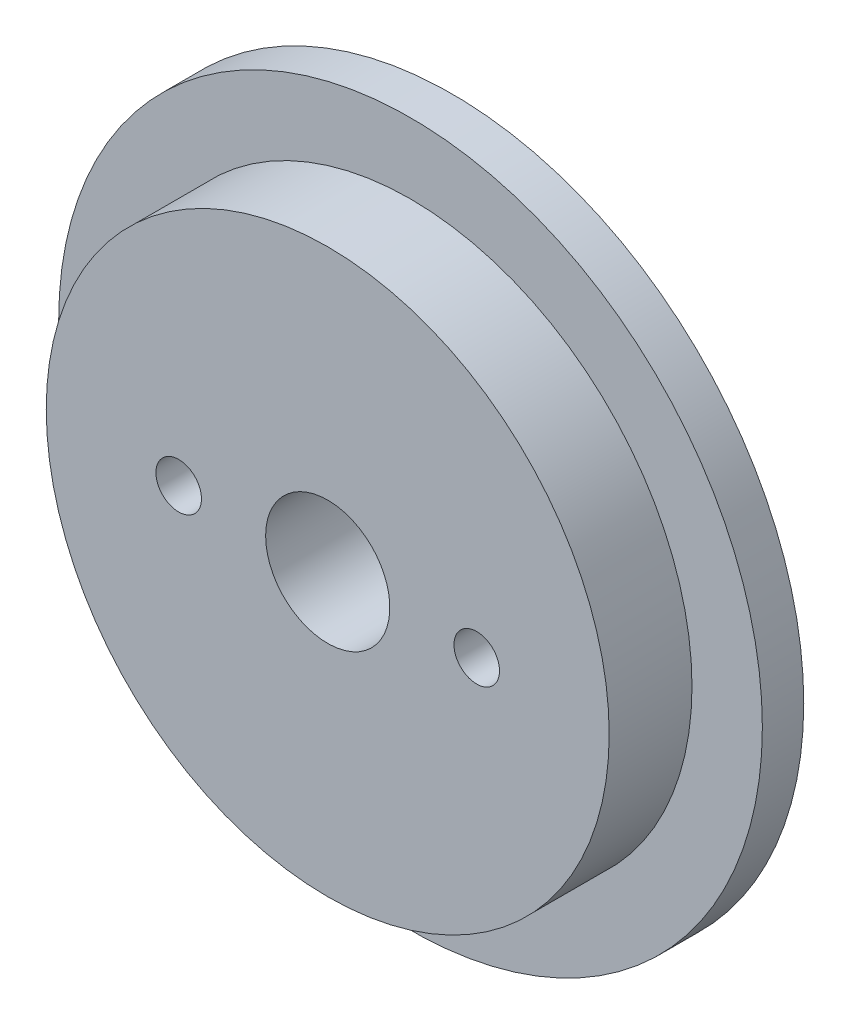
ISO-10303-21;
HEADER;
FILE_DESCRIPTION(('STEP AP214'),'2;1');
FILE_NAME('part.step','',(''),(''),'','','');
FILE_SCHEMA(('AUTOMOTIVE_DESIGN { 1 0 10303 214 1 1 1 1 }'));
ENDSEC;
DATA;
#1=APPLICATION_CONTEXT('core data for automotive mechanical design processes');
#2=APPLICATION_PROTOCOL_DEFINITION('international standard','automotive_design',2000,#1);
#3=PRODUCT_CONTEXT('',#1,'mechanical');
#4=PRODUCT('Part','Part','',(#3));
#5=PRODUCT_RELATED_PRODUCT_CATEGORY('part','',(#4));
#6=PRODUCT_DEFINITION_FORMATION('','',#4);
#7=PRODUCT_DEFINITION_CONTEXT('part definition',#1,'design');
#8=PRODUCT_DEFINITION('design','',#6,#7);
#9=PRODUCT_DEFINITION_SHAPE('','',#8);
#10=(LENGTH_UNIT() NAMED_UNIT(*) SI_UNIT(.MILLI.,.METRE.));
#11=(NAMED_UNIT(*) PLANE_ANGLE_UNIT() SI_UNIT($,.RADIAN.));
#12=(NAMED_UNIT(*) SI_UNIT($,.STERADIAN.) SOLID_ANGLE_UNIT());
#13=UNCERTAINTY_MEASURE_WITH_UNIT(LENGTH_MEASURE(1.E-05),#10,'distance_accuracy_value','');
#14=(GEOMETRIC_REPRESENTATION_CONTEXT(3) GLOBAL_UNCERTAINTY_ASSIGNED_CONTEXT((#13)) GLOBAL_UNIT_ASSIGNED_CONTEXT((#10,
#11,#12)) REPRESENTATION_CONTEXT('',''));
#15=CARTESIAN_POINT('',(0.,0.,0.));
#16=DIRECTION('',(0.,0.,1.));
#17=DIRECTION('',(1.,0.,0.));
#18=AXIS2_PLACEMENT_3D('',#15,#16,#17);
#19=CARTESIAN_POINT('',(0.,0.,10.));
#20=DIRECTION('',(0.,0.,-1.));
#21=DIRECTION('',(-1.,0.,0.));
#22=AXIS2_PLACEMENT_3D('',#19,#20,#21);
#23=CYLINDRICAL_SURFACE('',#22,34.);
#24=CARTESIAN_POINT('',(0.,0.,10.));
#25=DIRECTION('',(0.,0.,1.));
#26=DIRECTION('',(1.,0.,0.));
#27=AXIS2_PLACEMENT_3D('',#24,#25,#26);
#28=CIRCLE('',#27,34.);
#29=CARTESIAN_POINT('',(34.,0.,10.));
#30=VERTEX_POINT('',#29);
#31=EDGE_CURVE('E10',#30,#30,#28,.T.);
#32=ORIENTED_EDGE('',*,*,#31,.F.);
#33=EDGE_LOOP('',(#32));
#34=FACE_BOUND('',#33,.T.);
#35=CARTESIAN_POINT('',(0.,0.,0.));
#36=DIRECTION('',(0.,0.,1.));
#37=DIRECTION('',(1.,0.,0.));
#38=AXIS2_PLACEMENT_3D('',#35,#36,#37);
#39=CIRCLE('',#38,34.);
#40=CARTESIAN_POINT('',(34.,0.,0.));
#41=VERTEX_POINT('',#40);
#42=EDGE_CURVE('E39',#41,#41,#39,.T.);
#43=ORIENTED_EDGE('',*,*,#42,.T.);
#44=EDGE_LOOP('',(#43));
#45=FACE_BOUND('',#44,.T.);
#46=ADVANCED_FACE('F36',(#34,#45),#23,.T.);
#47=CARTESIAN_POINT('',(0.,0.,10.));
#48=DIRECTION('',(0.,0.,1.));
#49=DIRECTION('',(1.,0.,0.));
#50=AXIS2_PLACEMENT_3D('',#47,#48,#49);
#51=PLANE('',#50);
#52=CARTESIAN_POINT('',(-18.,0.,10.));
#53=DIRECTION('',(0.,0.,-1.));
#54=DIRECTION('',(-1.,0.,0.));
#55=AXIS2_PLACEMENT_3D('',#52,#53,#54);
#56=CIRCLE('',#55,2.75);
#57=CARTESIAN_POINT('',(-20.75,0.,10.));
#58=VERTEX_POINT('',#57);
#59=EDGE_CURVE('E73',#58,#58,#56,.T.);
#60=ORIENTED_EDGE('',*,*,#59,.T.);
#61=EDGE_LOOP('',(#60));
#62=FACE_BOUND('',#61,.T.);
#63=CARTESIAN_POINT('',(18.,0.,10.));
#64=DIRECTION('',(0.,0.,-1.));
#65=DIRECTION('',(-1.,0.,0.));
#66=AXIS2_PLACEMENT_3D('',#63,#64,#65);
#67=CIRCLE('',#66,2.75);
#68=CARTESIAN_POINT('',(15.25,0.,10.));
#69=VERTEX_POINT('',#68);
#70=EDGE_CURVE('E65',#69,#69,#67,.T.);
#71=ORIENTED_EDGE('',*,*,#70,.T.);
#72=EDGE_LOOP('',(#71));
#73=FACE_BOUND('',#72,.T.);
#74=CARTESIAN_POINT('',(0.,0.,10.));
#75=DIRECTION('',(0.,0.,-1.));
#76=DIRECTION('',(-1.,0.,0.));
#77=AXIS2_PLACEMENT_3D('',#74,#75,#76);
#78=CIRCLE('',#77,7.5);
#79=CARTESIAN_POINT('',(-7.5,0.,10.));
#80=VERTEX_POINT('',#79);
#81=EDGE_CURVE('E54',#80,#80,#78,.T.);
#82=ORIENTED_EDGE('',*,*,#81,.T.);
#83=EDGE_LOOP('',(#82));
#84=FACE_BOUND('',#83,.T.);
#85=ORIENTED_EDGE('',*,*,#31,.T.);
#86=EDGE_LOOP('',(#85));
#87=FACE_BOUND('',#86,.T.);
#88=ADVANCED_FACE('F98',(#62,#73,#84,#87),#51,.T.);
#89=CARTESIAN_POINT('',(0.,0.,-5.));
#90=DIRECTION('',(0.,0.,1.));
#91=DIRECTION('',(1.,0.,0.));
#92=AXIS2_PLACEMENT_3D('',#89,#90,#91);
#93=CYLINDRICAL_SURFACE('',#92,42.5);
#94=CARTESIAN_POINT('',(0.,0.,-5.));
#95=DIRECTION('',(0.,0.,-1.));
#96=DIRECTION('',(-1.,0.,0.));
#97=AXIS2_PLACEMENT_3D('',#94,#95,#96);
#98=CIRCLE('',#97,42.5);
#99=CARTESIAN_POINT('',(-42.5,0.,-5.));
#100=VERTEX_POINT('',#99);
#101=EDGE_CURVE('E48',#100,#100,#98,.T.);
#102=ORIENTED_EDGE('',*,*,#101,.F.);
#103=EDGE_LOOP('',(#102));
#104=FACE_BOUND('',#103,.T.);
#105=CARTESIAN_POINT('',(0.,0.,0.));
#106=DIRECTION('',(0.,0.,-1.));
#107=DIRECTION('',(-1.,0.,0.));
#108=AXIS2_PLACEMENT_3D('',#105,#106,#107);
#109=CIRCLE('',#108,42.5);
#110=CARTESIAN_POINT('',(-42.5,0.,0.));
#111=VERTEX_POINT('',#110);
#112=EDGE_CURVE('E50',#111,#111,#109,.T.);
#113=ORIENTED_EDGE('',*,*,#112,.T.);
#114=EDGE_LOOP('',(#113));
#115=FACE_BOUND('',#114,.T.);
#116=ADVANCED_FACE('F88',(#104,#115),#93,.T.);
#117=CARTESIAN_POINT('',(0.,0.,-5.));
#118=DIRECTION('',(0.,0.,-1.));
#119=DIRECTION('',(-1.,0.,0.));
#120=AXIS2_PLACEMENT_3D('',#117,#118,#119);
#121=PLANE('',#120);
#122=CARTESIAN_POINT('',(-18.,0.,-5.));
#123=DIRECTION('',(0.,0.,-1.));
#124=DIRECTION('',(-1.,0.,0.));
#125=AXIS2_PLACEMENT_3D('',#122,#123,#124);
#126=CIRCLE('',#125,2.75);
#127=CARTESIAN_POINT('',(-20.75,0.,-5.));
#128=VERTEX_POINT('',#127);
#129=EDGE_CURVE('E77',#128,#128,#126,.T.);
#130=ORIENTED_EDGE('',*,*,#129,.F.);
#131=EDGE_LOOP('',(#130));
#132=FACE_BOUND('',#131,.T.);
#133=CARTESIAN_POINT('',(18.,0.,-5.));
#134=DIRECTION('',(0.,0.,-1.));
#135=DIRECTION('',(-1.,0.,0.));
#136=AXIS2_PLACEMENT_3D('',#133,#134,#135);
#137=CIRCLE('',#136,2.75);
#138=CARTESIAN_POINT('',(15.25,0.,-5.));
#139=VERTEX_POINT('',#138);
#140=EDGE_CURVE('E69',#139,#139,#137,.T.);
#141=ORIENTED_EDGE('',*,*,#140,.F.);
#142=EDGE_LOOP('',(#141));
#143=FACE_BOUND('',#142,.T.);
#144=CARTESIAN_POINT('',(0.,0.,-5.));
#145=DIRECTION('',(0.,0.,-1.));
#146=DIRECTION('',(-1.,0.,0.));
#147=AXIS2_PLACEMENT_3D('',#144,#145,#146);
#148=CIRCLE('',#147,7.5);
#149=CARTESIAN_POINT('',(-7.5,0.,-5.));
#150=VERTEX_POINT('',#149);
#151=EDGE_CURVE('E61',#150,#150,#148,.T.);
#152=ORIENTED_EDGE('',*,*,#151,.F.);
#153=EDGE_LOOP('',(#152));
#154=FACE_BOUND('',#153,.T.);
#155=ORIENTED_EDGE('',*,*,#101,.T.);
#156=EDGE_LOOP('',(#155));
#157=FACE_BOUND('',#156,.T.);
#158=ADVANCED_FACE('F84',(#132,#143,#154,#157),#121,.T.);
#159=CARTESIAN_POINT('',(0.,0.,0.));
#160=DIRECTION('',(0.,0.,-1.));
#161=DIRECTION('',(-1.,0.,0.));
#162=AXIS2_PLACEMENT_3D('',#159,#160,#161);
#163=PLANE('',#162);
#164=ORIENTED_EDGE('',*,*,#42,.F.);
#165=EDGE_LOOP('',(#164));
#166=FACE_BOUND('',#165,.T.);
#167=ORIENTED_EDGE('',*,*,#112,.F.);
#168=EDGE_LOOP('',(#167));
#169=FACE_BOUND('',#168,.T.);
#170=ADVANCED_FACE('F87',(#166,#169),#163,.F.);
#171=CARTESIAN_POINT('',(0.,0.,-5.));
#172=DIRECTION('',(0.,0.,-1.));
#173=DIRECTION('',(-1.,0.,0.));
#174=AXIS2_PLACEMENT_3D('',#171,#172,#173);
#175=CYLINDRICAL_SURFACE('',#174,7.5);
#176=ORIENTED_EDGE('',*,*,#81,.F.);
#177=EDGE_LOOP('',(#176));
#178=FACE_BOUND('',#177,.T.);
#179=ORIENTED_EDGE('',*,*,#151,.T.);
#180=EDGE_LOOP('',(#179));
#181=FACE_BOUND('',#180,.T.);
#182=ADVANCED_FACE('F103',(#178,#181),#175,.F.);
#183=CARTESIAN_POINT('',(18.,0.,-5.));
#184=DIRECTION('',(0.,0.,-1.));
#185=DIRECTION('',(-1.,0.,0.));
#186=AXIS2_PLACEMENT_3D('',#183,#184,#185);
#187=CYLINDRICAL_SURFACE('',#186,2.75);
#188=ORIENTED_EDGE('',*,*,#70,.F.);
#189=EDGE_LOOP('',(#188));
#190=FACE_BOUND('',#189,.T.);
#191=ORIENTED_EDGE('',*,*,#140,.T.);
#192=EDGE_LOOP('',(#191));
#193=FACE_BOUND('',#192,.T.);
#194=ADVANCED_FACE('F109',(#190,#193),#187,.F.);
#195=CARTESIAN_POINT('',(-18.,0.,-5.));
#196=DIRECTION('',(0.,0.,-1.));
#197=DIRECTION('',(-1.,0.,0.));
#198=AXIS2_PLACEMENT_3D('',#195,#196,#197);
#199=CYLINDRICAL_SURFACE('',#198,2.75);
#200=ORIENTED_EDGE('',*,*,#59,.F.);
#201=EDGE_LOOP('',(#200));
#202=FACE_BOUND('',#201,.T.);
#203=ORIENTED_EDGE('',*,*,#129,.T.);
#204=EDGE_LOOP('',(#203));
#205=FACE_BOUND('',#204,.T.);
#206=ADVANCED_FACE('F82',(#202,#205),#199,.F.);
#207=CLOSED_SHELL('',(#46,#88,#116,#158,#170,#182,#194,#206));
#208=MANIFOLD_SOLID_BREP('B2',#207);
#209=ADVANCED_BREP_SHAPE_REPRESENTATION('',(#18,#208),#14);
#210=SHAPE_DEFINITION_REPRESENTATION(#9,#209);
ENDSEC;
END-ISO-10303-21;
